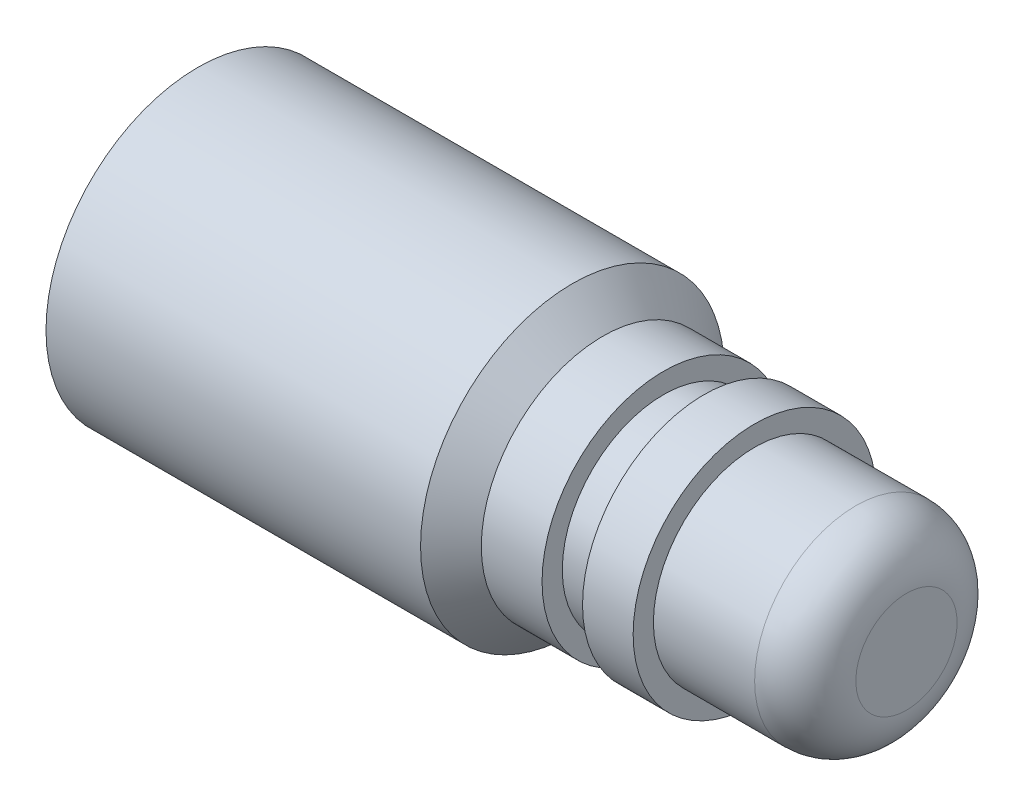
ISO-10303-21;
HEADER;
FILE_DESCRIPTION(('STEP AP214'),'2;1');
FILE_NAME('part.step','',(''),(''),'','','');
FILE_SCHEMA(('AUTOMOTIVE_DESIGN { 1 0 10303 214 1 1 1 1 }'));
ENDSEC;
DATA;
#1=APPLICATION_CONTEXT('core data for automotive mechanical design processes');
#2=APPLICATION_PROTOCOL_DEFINITION('international standard','automotive_design',2000,#1);
#3=PRODUCT_CONTEXT('',#1,'mechanical');
#4=PRODUCT('Part','Part','',(#3));
#5=PRODUCT_RELATED_PRODUCT_CATEGORY('part','',(#4));
#6=PRODUCT_DEFINITION_FORMATION('','',#4);
#7=PRODUCT_DEFINITION_CONTEXT('part definition',#1,'design');
#8=PRODUCT_DEFINITION('design','',#6,#7);
#9=PRODUCT_DEFINITION_SHAPE('','',#8);
#10=(LENGTH_UNIT() NAMED_UNIT(*) SI_UNIT(.MILLI.,.METRE.));
#11=(NAMED_UNIT(*) PLANE_ANGLE_UNIT() SI_UNIT($,.RADIAN.));
#12=(NAMED_UNIT(*) SI_UNIT($,.STERADIAN.) SOLID_ANGLE_UNIT());
#13=UNCERTAINTY_MEASURE_WITH_UNIT(LENGTH_MEASURE(1.E-05),#10,'distance_accuracy_value','');
#14=(GEOMETRIC_REPRESENTATION_CONTEXT(3) GLOBAL_UNCERTAINTY_ASSIGNED_CONTEXT((#13)) GLOBAL_UNIT_ASSIGNED_CONTEXT((#10,
#11,#12)) REPRESENTATION_CONTEXT('',''));
#15=CARTESIAN_POINT('',(0.,0.,0.));
#16=DIRECTION('',(0.,0.,1.));
#17=DIRECTION('',(1.,0.,0.));
#18=AXIS2_PLACEMENT_3D('',#15,#16,#17);
#19=CARTESIAN_POINT('',(0.,0.,0.));
#20=DIRECTION('',(-1.,0.,0.));
#21=DIRECTION('',(0.,0.,1.));
#22=AXIS2_PLACEMENT_3D('',#19,#20,#21);
#23=PLANE('',#22);
#24=CARTESIAN_POINT('',(0.,0.,0.));
#25=DIRECTION('',(-1.,0.,0.));
#26=DIRECTION('',(0.,0.,1.));
#27=AXIS2_PLACEMENT_3D('',#24,#25,#26);
#28=CIRCLE('',#27,15.);
#29=CARTESIAN_POINT('',(0.,0.,15.));
#30=VERTEX_POINT('',#29);
#31=EDGE_CURVE('E73',#30,#30,#28,.T.);
#32=ORIENTED_EDGE('',*,*,#31,.T.);
#33=EDGE_LOOP('',(#32));
#34=FACE_BOUND('',#33,.T.);
#35=ADVANCED_FACE('F35',(#34),#23,.T.);
#36=CARTESIAN_POINT('',(70.,1.94289029309402E-13,0.));
#37=DIRECTION('',(1.,0.,0.));
#38=DIRECTION('',(0.,0.,-1.));
#39=AXIS2_PLACEMENT_3D('',#36,#37,#38);
#40=PLANE('',#39);
#41=CARTESIAN_POINT('',(70.,0.,0.));
#42=DIRECTION('',(1.,0.,0.));
#43=DIRECTION('',(0.,0.,-1.));
#44=AXIS2_PLACEMENT_3D('',#41,#42,#43);
#45=CIRCLE('',#44,5.00000000000001);
#46=CARTESIAN_POINT('',(70.,0.,-5.00000000000001));
#47=VERTEX_POINT('',#46);
#48=EDGE_CURVE('E42',#47,#47,#45,.T.);
#49=ORIENTED_EDGE('',*,*,#48,.T.);
#50=EDGE_LOOP('',(#49));
#51=FACE_BOUND('',#50,.T.);
#52=ADVANCED_FACE('F92',(#51),#40,.T.);
#53=CARTESIAN_POINT('',(-5.44986217727433,0.,0.));
#54=DIRECTION('',(-1.,0.,0.));
#55=DIRECTION('',(0.,0.,1.));
#56=AXIS2_PLACEMENT_3D('',#53,#54,#55);
#57=CYLINDRICAL_SURFACE('',#56,10.);
#58=CARTESIAN_POINT('',(65.,0.,0.));
#59=DIRECTION('',(1.,0.,0.));
#60=DIRECTION('',(0.,0.,-1.));
#61=AXIS2_PLACEMENT_3D('',#58,#59,#60);
#62=CIRCLE('',#61,10.);
#63=CARTESIAN_POINT('',(65.,0.,-10.));
#64=VERTEX_POINT('',#63);
#65=EDGE_CURVE('E46',#64,#64,#62,.F.);
#66=ORIENTED_EDGE('',*,*,#65,.T.);
#67=EDGE_LOOP('',(#66));
#68=FACE_BOUND('',#67,.T.);
#69=CARTESIAN_POINT('',(55.,0.,0.));
#70=DIRECTION('',(-1.,0.,0.));
#71=DIRECTION('',(0.,0.,1.));
#72=AXIS2_PLACEMENT_3D('',#69,#70,#71);
#73=CIRCLE('',#72,10.);
#74=CARTESIAN_POINT('',(55.,0.,10.));
#75=VERTEX_POINT('',#74);
#76=EDGE_CURVE('E50',#75,#75,#73,.T.);
#77=ORIENTED_EDGE('',*,*,#76,.F.);
#78=EDGE_LOOP('',(#77));
#79=FACE_BOUND('',#78,.T.);
#80=ADVANCED_FACE('F97',(#68,#79),#57,.T.);
#81=CARTESIAN_POINT('',(55.,-1.9081958235745E-13,0.));
#82=DIRECTION('',(1.,0.,0.));
#83=DIRECTION('',(0.,0.,-1.));
#84=AXIS2_PLACEMENT_3D('',#81,#82,#83);
#85=PLANE('',#84);
#86=ORIENTED_EDGE('',*,*,#76,.T.);
#87=EDGE_LOOP('',(#86));
#88=FACE_BOUND('',#87,.T.);
#89=CARTESIAN_POINT('',(55.,0.,0.));
#90=DIRECTION('',(-1.,0.,0.));
#91=DIRECTION('',(0.,0.,1.));
#92=AXIS2_PLACEMENT_3D('',#89,#90,#91);
#93=CIRCLE('',#92,12.);
#94=CARTESIAN_POINT('',(55.,0.,12.));
#95=VERTEX_POINT('',#94);
#96=EDGE_CURVE('E55',#95,#95,#93,.T.);
#97=ORIENTED_EDGE('',*,*,#96,.F.);
#98=EDGE_LOOP('',(#97));
#99=FACE_BOUND('',#98,.T.);
#100=ADVANCED_FACE('F102',(#88,#99),#85,.T.);
#101=CARTESIAN_POINT('',(-5.44986217727433,0.,0.));
#102=DIRECTION('',(-1.,0.,0.));
#103=DIRECTION('',(0.,0.,1.));
#104=AXIS2_PLACEMENT_3D('',#101,#102,#103);
#105=CYLINDRICAL_SURFACE('',#104,12.);
#106=ORIENTED_EDGE('',*,*,#96,.T.);
#107=EDGE_LOOP('',(#106));
#108=FACE_BOUND('',#107,.T.);
#109=CARTESIAN_POINT('',(50.,0.,0.));
#110=DIRECTION('',(-1.,0.,0.));
#111=DIRECTION('',(0.,0.,1.));
#112=AXIS2_PLACEMENT_3D('',#109,#110,#111);
#113=CIRCLE('',#112,12.);
#114=CARTESIAN_POINT('',(50.,0.,12.));
#115=VERTEX_POINT('',#114);
#116=EDGE_CURVE('E58',#115,#115,#113,.T.);
#117=ORIENTED_EDGE('',*,*,#116,.F.);
#118=EDGE_LOOP('',(#117));
#119=FACE_BOUND('',#118,.T.);
#120=ADVANCED_FACE('F106',(#108,#119),#105,.T.);
#121=CARTESIAN_POINT('',(50.,1.73472347597681E-13,0.));
#122=DIRECTION('',(-1.,0.,0.));
#123=DIRECTION('',(0.,0.,1.));
#124=AXIS2_PLACEMENT_3D('',#121,#122,#123);
#125=PLANE('',#124);
#126=ORIENTED_EDGE('',*,*,#116,.T.);
#127=EDGE_LOOP('',(#126));
#128=FACE_BOUND('',#127,.T.);
#129=CARTESIAN_POINT('',(50.,0.,0.));
#130=DIRECTION('',(-1.,0.,0.));
#131=DIRECTION('',(0.,0.,1.));
#132=AXIS2_PLACEMENT_3D('',#129,#130,#131);
#133=CIRCLE('',#132,9.99999999999999);
#134=CARTESIAN_POINT('',(50.,0.,9.99999999999999));
#135=VERTEX_POINT('',#134);
#136=EDGE_CURVE('E61',#135,#135,#133,.T.);
#137=ORIENTED_EDGE('',*,*,#136,.F.);
#138=EDGE_LOOP('',(#137));
#139=FACE_BOUND('',#138,.T.);
#140=ADVANCED_FACE('F110',(#128,#139),#125,.T.);
#141=CARTESIAN_POINT('',(-5.44986217727433,0.,0.));
#142=DIRECTION('',(-1.,0.,0.));
#143=DIRECTION('',(0.,0.,1.));
#144=AXIS2_PLACEMENT_3D('',#141,#142,#143);
#145=CYLINDRICAL_SURFACE('',#144,10.);
#146=ORIENTED_EDGE('',*,*,#136,.T.);
#147=EDGE_LOOP('',(#146));
#148=FACE_BOUND('',#147,.T.);
#149=CARTESIAN_POINT('',(45.9999999999999,0.,0.));
#150=DIRECTION('',(-1.,0.,0.));
#151=DIRECTION('',(0.,0.,1.));
#152=AXIS2_PLACEMENT_3D('',#149,#150,#151);
#153=CIRCLE('',#152,10.);
#154=CARTESIAN_POINT('',(45.9999999999999,0.,10.));
#155=VERTEX_POINT('',#154);
#156=EDGE_CURVE('E64',#155,#155,#153,.T.);
#157=ORIENTED_EDGE('',*,*,#156,.F.);
#158=EDGE_LOOP('',(#157));
#159=FACE_BOUND('',#158,.T.);
#160=ADVANCED_FACE('F114',(#148,#159),#145,.T.);
#161=CARTESIAN_POINT('',(45.9999999999999,0.,0.));
#162=DIRECTION('',(1.,0.,0.));
#163=DIRECTION('',(0.,0.,-1.));
#164=AXIS2_PLACEMENT_3D('',#161,#162,#163);
#165=PLANE('',#164);
#166=ORIENTED_EDGE('',*,*,#156,.T.);
#167=EDGE_LOOP('',(#166));
#168=FACE_BOUND('',#167,.T.);
#169=CARTESIAN_POINT('',(45.9999999999999,0.,0.));
#170=DIRECTION('',(-1.,0.,0.));
#171=DIRECTION('',(0.,0.,1.));
#172=AXIS2_PLACEMENT_3D('',#169,#170,#171);
#173=CIRCLE('',#172,12.);
#174=CARTESIAN_POINT('',(45.9999999999999,0.,12.));
#175=VERTEX_POINT('',#174);
#176=EDGE_CURVE('E67',#175,#175,#173,.T.);
#177=ORIENTED_EDGE('',*,*,#176,.F.);
#178=EDGE_LOOP('',(#177));
#179=FACE_BOUND('',#178,.T.);
#180=ADVANCED_FACE('F88',(#168,#179),#165,.T.);
#181=CARTESIAN_POINT('',(-5.44986217727433,0.,0.));
#182=DIRECTION('',(-1.,0.,0.));
#183=DIRECTION('',(0.,0.,1.));
#184=AXIS2_PLACEMENT_3D('',#181,#182,#183);
#185=CYLINDRICAL_SURFACE('',#184,12.);
#186=ORIENTED_EDGE('',*,*,#176,.T.);
#187=EDGE_LOOP('',(#186));
#188=FACE_BOUND('',#187,.T.);
#189=CARTESIAN_POINT('',(40.,0.,0.));
#190=DIRECTION('',(-1.,0.,0.));
#191=DIRECTION('',(0.,0.,1.));
#192=AXIS2_PLACEMENT_3D('',#189,#190,#191);
#193=CIRCLE('',#192,12.);
#194=CARTESIAN_POINT('',(40.,0.,12.));
#195=VERTEX_POINT('',#194);
#196=EDGE_CURVE('E70',#195,#195,#193,.T.);
#197=ORIENTED_EDGE('',*,*,#196,.F.);
#198=EDGE_LOOP('',(#197));
#199=FACE_BOUND('',#198,.T.);
#200=ADVANCED_FACE('F81',(#188,#199),#185,.T.);
#201=CARTESIAN_POINT('',(-5.44986217727433,0.,0.));
#202=DIRECTION('',(-1.,0.,0.));
#203=DIRECTION('',(0.,0.,1.));
#204=AXIS2_PLACEMENT_3D('',#201,#202,#203);
#205=CYLINDRICAL_SURFACE('',#204,15.);
#206=CARTESIAN_POINT('',(37.,0.,0.));
#207=DIRECTION('',(1.,0.,0.));
#208=DIRECTION('',(0.,0.,-1.));
#209=AXIS2_PLACEMENT_3D('',#206,#207,#208);
#210=CIRCLE('',#209,15.);
#211=CARTESIAN_POINT('',(37.,0.,-15.));
#212=VERTEX_POINT('',#211);
#213=EDGE_CURVE('E10',#212,#212,#210,.F.);
#214=ORIENTED_EDGE('',*,*,#213,.T.);
#215=EDGE_LOOP('',(#214));
#216=FACE_BOUND('',#215,.T.);
#217=ORIENTED_EDGE('',*,*,#31,.F.);
#218=EDGE_LOOP('',(#217));
#219=FACE_BOUND('',#218,.T.);
#220=ADVANCED_FACE('F78',(#216,#219),#205,.T.);
#221=CARTESIAN_POINT('',(65.,0.,0.));
#222=DIRECTION('',(1.,0.,0.));
#223=DIRECTION('',(0.,0.,-1.));
#224=AXIS2_PLACEMENT_3D('',#221,#222,#223);
#225=TOROIDAL_SURFACE('',#224,5.00000000000001,5.);
#226=ORIENTED_EDGE('',*,*,#48,.F.);
#227=EDGE_LOOP('',(#226));
#228=FACE_BOUND('',#227,.T.);
#229=ORIENTED_EDGE('',*,*,#65,.F.);
#230=EDGE_LOOP('',(#229));
#231=FACE_BOUND('',#230,.T.);
#232=ADVANCED_FACE('F80',(#228,#231),#225,.T.);
#233=CARTESIAN_POINT('',(37.,0.,0.));
#234=DIRECTION('',(-1.,0.,0.));
#235=DIRECTION('',(0.,0.,1.));
#236=AXIS2_PLACEMENT_3D('',#233,#234,#235);
#237=CONICAL_SURFACE('',#236,15.,0.785398163397451);
#238=ORIENTED_EDGE('',*,*,#196,.T.);
#239=EDGE_LOOP('',(#238));
#240=FACE_BOUND('',#239,.T.);
#241=ORIENTED_EDGE('',*,*,#213,.F.);
#242=EDGE_LOOP('',(#241));
#243=FACE_BOUND('',#242,.T.);
#244=ADVANCED_FACE('F37',(#240,#243),#237,.T.);
#245=CLOSED_SHELL('',(#35,#52,#80,#100,#120,#140,#160,#180,#200,#220,#232,#244));
#246=MANIFOLD_SOLID_BREP('B2',#245);
#247=ADVANCED_BREP_SHAPE_REPRESENTATION('',(#18,#246),#14);
#248=SHAPE_DEFINITION_REPRESENTATION(#9,#247);
ENDSEC;
END-ISO-10303-21;
